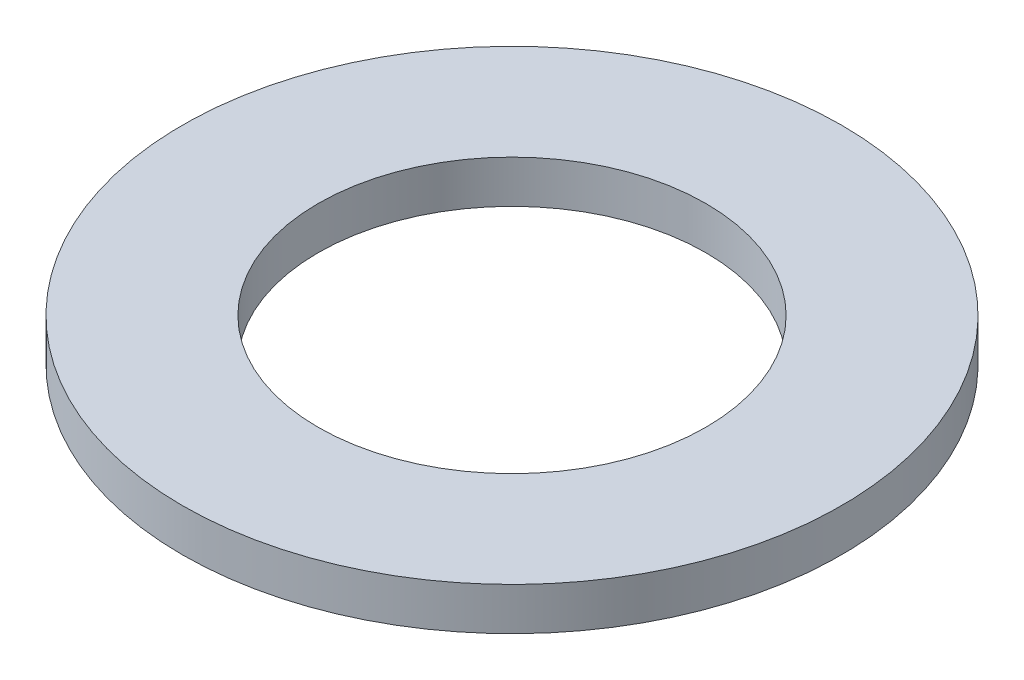
ISO-10303-21;
HEADER;
FILE_DESCRIPTION(('STEP AP214'),'2;1');
FILE_NAME('part.step','',(''),(''),'','','');
FILE_SCHEMA(('AUTOMOTIVE_DESIGN { 1 0 10303 214 1 1 1 1 }'));
ENDSEC;
DATA;
#1=APPLICATION_CONTEXT('core data for automotive mechanical design processes');
#2=APPLICATION_PROTOCOL_DEFINITION('international standard','automotive_design',2000,#1);
#3=PRODUCT_CONTEXT('',#1,'mechanical');
#4=PRODUCT('Part','Part','',(#3));
#5=PRODUCT_RELATED_PRODUCT_CATEGORY('part','',(#4));
#6=PRODUCT_DEFINITION_FORMATION('','',#4);
#7=PRODUCT_DEFINITION_CONTEXT('part definition',#1,'design');
#8=PRODUCT_DEFINITION('design','',#6,#7);
#9=PRODUCT_DEFINITION_SHAPE('','',#8);
#10=(LENGTH_UNIT() NAMED_UNIT(*) SI_UNIT(.MILLI.,.METRE.));
#11=(NAMED_UNIT(*) PLANE_ANGLE_UNIT() SI_UNIT($,.RADIAN.));
#12=(NAMED_UNIT(*) SI_UNIT($,.STERADIAN.) SOLID_ANGLE_UNIT());
#13=UNCERTAINTY_MEASURE_WITH_UNIT(LENGTH_MEASURE(1.E-05),#10,'distance_accuracy_value','');
#14=(GEOMETRIC_REPRESENTATION_CONTEXT(3) GLOBAL_UNCERTAINTY_ASSIGNED_CONTEXT((#13)) GLOBAL_UNIT_ASSIGNED_CONTEXT((#10,
#11,#12)) REPRESENTATION_CONTEXT('',''));
#15=CARTESIAN_POINT('',(0.,0.,0.));
#16=DIRECTION('',(0.,0.,1.));
#17=DIRECTION('',(1.,0.,0.));
#18=AXIS2_PLACEMENT_3D('',#15,#16,#17);
#19=CARTESIAN_POINT('',(0.,11.,0.));
#20=DIRECTION('',(0.,-1.,0.));
#21=DIRECTION('',(0.,0.,-1.));
#22=AXIS2_PLACEMENT_3D('',#19,#20,#21);
#23=CYLINDRICAL_SURFACE('',#22,85.);
#24=CARTESIAN_POINT('',(0.,11.,0.));
#25=DIRECTION('',(0.,1.,0.));
#26=DIRECTION('',(0.,0.,1.));
#27=AXIS2_PLACEMENT_3D('',#24,#25,#26);
#28=CIRCLE('',#27,85.);
#29=CARTESIAN_POINT('',(0.,11.,85.));
#30=VERTEX_POINT('',#29);
#31=EDGE_CURVE('E10',#30,#30,#28,.T.);
#32=ORIENTED_EDGE('',*,*,#31,.F.);
#33=EDGE_LOOP('',(#32));
#34=FACE_BOUND('',#33,.T.);
#35=CARTESIAN_POINT('',(0.,0.,0.));
#36=DIRECTION('',(0.,1.,0.));
#37=DIRECTION('',(0.,0.,1.));
#38=AXIS2_PLACEMENT_3D('',#35,#36,#37);
#39=CIRCLE('',#38,85.);
#40=CARTESIAN_POINT('',(0.,0.,85.));
#41=VERTEX_POINT('',#40);
#42=EDGE_CURVE('E37',#41,#41,#39,.T.);
#43=ORIENTED_EDGE('',*,*,#42,.T.);
#44=EDGE_LOOP('',(#43));
#45=FACE_BOUND('',#44,.T.);
#46=ADVANCED_FACE('F40',(#34,#45),#23,.T.);
#47=CARTESIAN_POINT('',(0.,11.,0.));
#48=DIRECTION('',(0.,1.,0.));
#49=DIRECTION('',(0.,0.,1.));
#50=AXIS2_PLACEMENT_3D('',#47,#48,#49);
#51=PLANE('',#50);
#52=CARTESIAN_POINT('',(0.,11.,0.));
#53=DIRECTION('',(0.,1.,0.));
#54=DIRECTION('',(0.,0.,1.));
#55=AXIS2_PLACEMENT_3D('',#52,#53,#54);
#56=CIRCLE('',#55,50.);
#57=CARTESIAN_POINT('',(0.,11.,50.));
#58=VERTEX_POINT('',#57);
#59=EDGE_CURVE('E50',#58,#58,#56,.T.);
#60=ORIENTED_EDGE('',*,*,#59,.F.);
#61=EDGE_LOOP('',(#60));
#62=FACE_BOUND('',#61,.T.);
#63=ORIENTED_EDGE('',*,*,#31,.T.);
#64=EDGE_LOOP('',(#63));
#65=FACE_BOUND('',#64,.T.);
#66=ADVANCED_FACE('F59',(#62,#65),#51,.T.);
#67=CARTESIAN_POINT('',(0.,0.,0.));
#68=DIRECTION('',(0.,1.,0.));
#69=DIRECTION('',(0.,0.,1.));
#70=AXIS2_PLACEMENT_3D('',#67,#68,#69);
#71=PLANE('',#70);
#72=CARTESIAN_POINT('',(0.,0.,0.));
#73=DIRECTION('',(0.,1.,0.));
#74=DIRECTION('',(0.,0.,1.));
#75=AXIS2_PLACEMENT_3D('',#72,#73,#74);
#76=CIRCLE('',#75,50.);
#77=CARTESIAN_POINT('',(0.,0.,50.));
#78=VERTEX_POINT('',#77);
#79=EDGE_CURVE('E47',#78,#78,#76,.T.);
#80=ORIENTED_EDGE('',*,*,#79,.T.);
#81=EDGE_LOOP('',(#80));
#82=FACE_BOUND('',#81,.T.);
#83=ORIENTED_EDGE('',*,*,#42,.F.);
#84=EDGE_LOOP('',(#83));
#85=FACE_BOUND('',#84,.T.);
#86=ADVANCED_FACE('F58',(#82,#85),#71,.F.);
#87=CARTESIAN_POINT('',(0.,11.,0.));
#88=DIRECTION('',(0.,-1.,0.));
#89=DIRECTION('',(0.,0.,-1.));
#90=AXIS2_PLACEMENT_3D('',#87,#88,#89);
#91=CYLINDRICAL_SURFACE('',#90,50.);
#92=ORIENTED_EDGE('',*,*,#59,.T.);
#93=EDGE_LOOP('',(#92));
#94=FACE_BOUND('',#93,.T.);
#95=ORIENTED_EDGE('',*,*,#79,.F.);
#96=EDGE_LOOP('',(#95));
#97=FACE_BOUND('',#96,.T.);
#98=ADVANCED_FACE('F54',(#94,#97),#91,.F.);
#99=CLOSED_SHELL('',(#46,#66,#86,#98));
#100=MANIFOLD_SOLID_BREP('B2',#99);
#101=ADVANCED_BREP_SHAPE_REPRESENTATION('',(#18,#100),#14);
#102=SHAPE_DEFINITION_REPRESENTATION(#9,#101);
ENDSEC;
END-ISO-10303-21;
